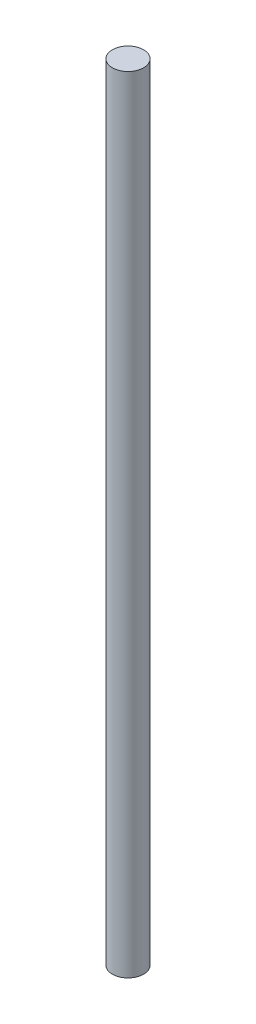
ISO-10303-21;
HEADER;
FILE_DESCRIPTION(('STEP AP214'),'2;1');
FILE_NAME('part.step','',(''),(''),'','','');
FILE_SCHEMA(('AUTOMOTIVE_DESIGN { 1 0 10303 214 1 1 1 1 }'));
ENDSEC;
DATA;
#1=APPLICATION_CONTEXT('core data for automotive mechanical design processes');
#2=APPLICATION_PROTOCOL_DEFINITION('international standard','automotive_design',2000,#1);
#3=PRODUCT_CONTEXT('',#1,'mechanical');
#4=PRODUCT('Part','Part','',(#3));
#5=PRODUCT_RELATED_PRODUCT_CATEGORY('part','',(#4));
#6=PRODUCT_DEFINITION_FORMATION('','',#4);
#7=PRODUCT_DEFINITION_CONTEXT('part definition',#1,'design');
#8=PRODUCT_DEFINITION('design','',#6,#7);
#9=PRODUCT_DEFINITION_SHAPE('','',#8);
#10=(LENGTH_UNIT() NAMED_UNIT(*) SI_UNIT(.MILLI.,.METRE.));
#11=(NAMED_UNIT(*) PLANE_ANGLE_UNIT() SI_UNIT($,.RADIAN.));
#12=(NAMED_UNIT(*) SI_UNIT($,.STERADIAN.) SOLID_ANGLE_UNIT());
#13=UNCERTAINTY_MEASURE_WITH_UNIT(LENGTH_MEASURE(1.E-05),#10,'distance_accuracy_value','');
#14=(GEOMETRIC_REPRESENTATION_CONTEXT(3) GLOBAL_UNCERTAINTY_ASSIGNED_CONTEXT((#13)) GLOBAL_UNIT_ASSIGNED_CONTEXT((#10,
#11,#12)) REPRESENTATION_CONTEXT('',''));
#15=CARTESIAN_POINT('',(0.,0.,0.));
#16=DIRECTION('',(0.,0.,1.));
#17=DIRECTION('',(1.,0.,0.));
#18=AXIS2_PLACEMENT_3D('',#15,#16,#17);
#19=CARTESIAN_POINT('',(0.,239.,0.));
#20=DIRECTION('',(0.,1.,0.));
#21=DIRECTION('',(-1.,0.,0.));
#22=AXIS2_PLACEMENT_3D('',#19,#20,#21);
#23=PLANE('',#22);
#24=CARTESIAN_POINT('',(4.7625,239.,0.));
#25=DIRECTION('',(0.,1.,0.));
#26=DIRECTION('',(-1.,0.,0.));
#27=AXIS2_PLACEMENT_3D('',#24,#25,#26);
#28=CIRCLE('',#27,4.7625);
#29=CARTESIAN_POINT('',(0.,239.,0.));
#30=VERTEX_POINT('',#29);
#31=EDGE_CURVE('E10',#30,#30,#28,.T.);
#32=ORIENTED_EDGE('',*,*,#31,.T.);
#33=EDGE_LOOP('',(#32));
#34=FACE_BOUND('',#33,.T.);
#35=ADVANCED_FACE('F37',(#34),#23,.T.);
#36=CARTESIAN_POINT('',(4.7625,239.,0.));
#37=DIRECTION('',(0.,1.,0.));
#38=DIRECTION('',(-1.,0.,0.));
#39=AXIS2_PLACEMENT_3D('',#36,#37,#38);
#40=CYLINDRICAL_SURFACE('',#39,4.76250000000002);
#41=CARTESIAN_POINT('',(4.76250000000003,0.,0.));
#42=DIRECTION('',(0.,1.,0.));
#43=DIRECTION('',(-1.,0.,0.));
#44=AXIS2_PLACEMENT_3D('',#41,#42,#43);
#45=CIRCLE('',#44,4.76250000000003);
#46=CARTESIAN_POINT('',(0.,0.,0.));
#47=VERTEX_POINT('',#46);
#48=EDGE_CURVE('E43',#47,#47,#45,.T.);
#49=ORIENTED_EDGE('',*,*,#48,.T.);
#50=EDGE_LOOP('',(#49));
#51=FACE_BOUND('',#50,.T.);
#52=ORIENTED_EDGE('',*,*,#31,.F.);
#53=EDGE_LOOP('',(#52));
#54=FACE_BOUND('',#53,.T.);
#55=ADVANCED_FACE('F49',(#51,#54),#40,.T.);
#56=CARTESIAN_POINT('',(0.,0.,0.));
#57=DIRECTION('',(0.,-1.,0.));
#58=DIRECTION('',(1.,0.,0.));
#59=AXIS2_PLACEMENT_3D('',#56,#57,#58);
#60=PLANE('',#59);
#61=ORIENTED_EDGE('',*,*,#48,.F.);
#62=EDGE_LOOP('',(#61));
#63=FACE_BOUND('',#62,.T.);
#64=ADVANCED_FACE('F52',(#63),#60,.T.);
#65=CLOSED_SHELL('',(#35,#55,#64));
#66=MANIFOLD_SOLID_BREP('B2',#65);
#67=ADVANCED_BREP_SHAPE_REPRESENTATION('',(#18,#66),#14);
#68=SHAPE_DEFINITION_REPRESENTATION(#9,#67);
ENDSEC;
END-ISO-10303-21;
